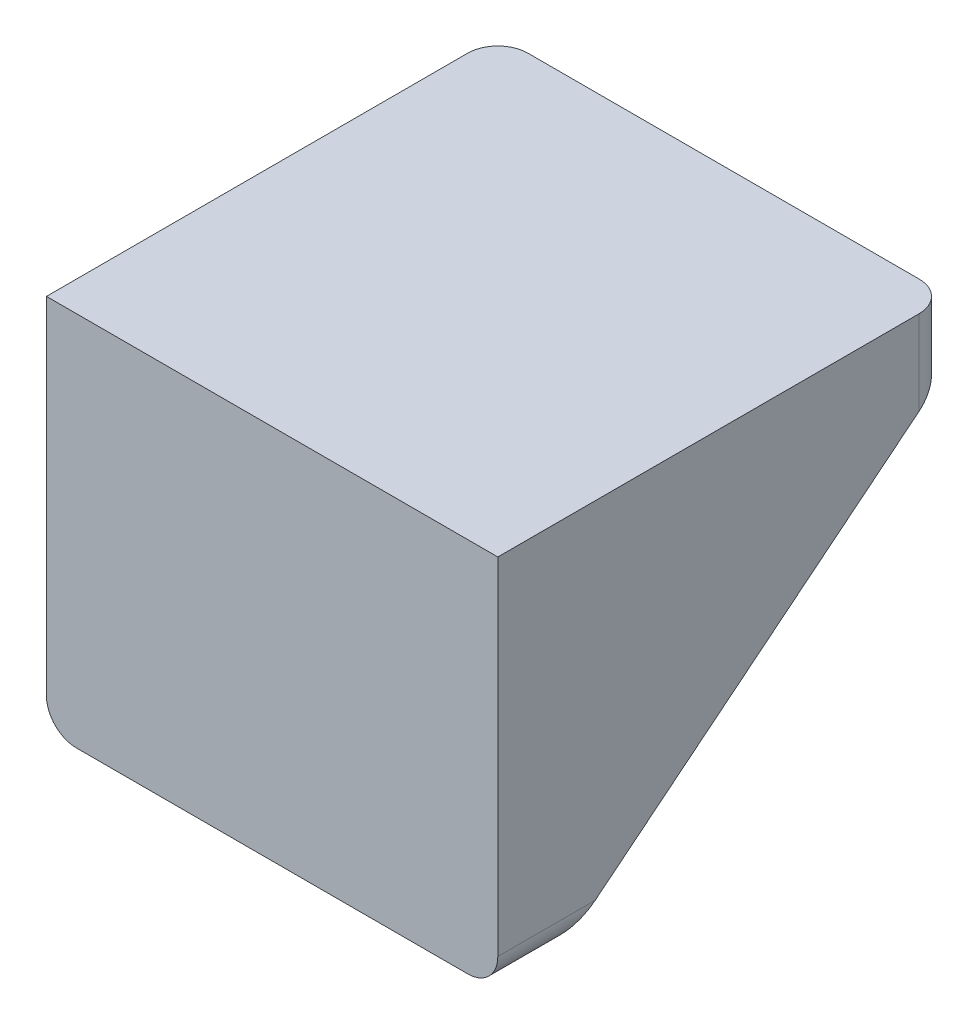
ISO-10303-21;
HEADER;
FILE_DESCRIPTION(('STEP AP214'),'2;1');
FILE_NAME('part.step','',(''),(''),'','','');
FILE_SCHEMA(('AUTOMOTIVE_DESIGN { 1 0 10303 214 1 1 1 1 }'));
ENDSEC;
DATA;
#1=APPLICATION_CONTEXT('core data for automotive mechanical design processes');
#2=APPLICATION_PROTOCOL_DEFINITION('international standard','automotive_design',2000,#1);
#3=PRODUCT_CONTEXT('',#1,'mechanical');
#4=PRODUCT('Part','Part','',(#3));
#5=PRODUCT_RELATED_PRODUCT_CATEGORY('part','',(#4));
#6=PRODUCT_DEFINITION_FORMATION('','',#4);
#7=PRODUCT_DEFINITION_CONTEXT('part definition',#1,'design');
#8=PRODUCT_DEFINITION('design','',#6,#7);
#9=PRODUCT_DEFINITION_SHAPE('','',#8);
#10=(LENGTH_UNIT() NAMED_UNIT(*) SI_UNIT(.MILLI.,.METRE.));
#11=(NAMED_UNIT(*) PLANE_ANGLE_UNIT() SI_UNIT($,.RADIAN.));
#12=(NAMED_UNIT(*) SI_UNIT($,.STERADIAN.) SOLID_ANGLE_UNIT());
#13=UNCERTAINTY_MEASURE_WITH_UNIT(LENGTH_MEASURE(1.E-05),#10,'distance_accuracy_value','');
#14=(GEOMETRIC_REPRESENTATION_CONTEXT(3) GLOBAL_UNCERTAINTY_ASSIGNED_CONTEXT((#13)) GLOBAL_UNIT_ASSIGNED_CONTEXT((#10,
#11,#12)) REPRESENTATION_CONTEXT('',''));
#15=CARTESIAN_POINT('',(0.,0.,0.));
#16=DIRECTION('',(0.,0.,1.));
#17=DIRECTION('',(1.,0.,0.));
#18=AXIS2_PLACEMENT_3D('',#15,#16,#17);
#19=CARTESIAN_POINT('',(15.,-12.5,-4.));
#20=DIRECTION('',(0.,0.,1.));
#21=DIRECTION('',(1.,0.,0.));
#22=AXIS2_PLACEMENT_3D('',#19,#20,#21);
#23=PLANE('',#22);
#24=DIRECTION('',(0.,-1.,0.));
#25=VECTOR('',#24,1.);
#26=CARTESIAN_POINT('',(-11.,-12.5,-4.));
#27=LINE('',#26,#25);
#28=CARTESIAN_POINT('',(-11.,8.5,-4.));
#29=VERTEX_POINT('',#28);
#30=CARTESIAN_POINT('',(-11.,-12.5,-4.));
#31=VERTEX_POINT('',#30);
#32=EDGE_CURVE('E145',#29,#31,#27,.T.);
#33=ORIENTED_EDGE('',*,*,#32,.F.);
#34=DIRECTION('',(-1.,0.,0.));
#35=VECTOR('',#34,1.);
#36=CARTESIAN_POINT('',(15.,8.5,-4.));
#37=LINE('',#36,#35);
#38=CARTESIAN_POINT('',(11.,8.5,-4.));
#39=VERTEX_POINT('',#38);
#40=EDGE_CURVE('E138',#39,#29,#37,.T.);
#41=ORIENTED_EDGE('',*,*,#40,.F.);
#42=DIRECTION('',(0.,-1.,0.));
#43=VECTOR('',#42,1.);
#44=CARTESIAN_POINT('',(11.,-12.5,-4.));
#45=LINE('',#44,#43);
#46=CARTESIAN_POINT('',(11.,-12.5,-4.));
#47=VERTEX_POINT('',#46);
#48=EDGE_CURVE('E123',#39,#47,#45,.T.);
#49=ORIENTED_EDGE('',*,*,#48,.T.);
#50=DIRECTION('',(-1.,0.,0.));
#51=VECTOR('',#50,1.);
#52=CARTESIAN_POINT('',(15.,-12.5,-4.));
#53=LINE('',#52,#51);
#54=EDGE_CURVE('E146',#47,#31,#53,.T.);
#55=ORIENTED_EDGE('',*,*,#54,.T.);
#56=EDGE_LOOP('',(#33,#41,#49,#55));
#57=FACE_BOUND('',#56,.T.);
#58=ADVANCED_FACE('F33',(#57),#23,.F.);
#59=CARTESIAN_POINT('',(15.,8.5,-4.));
#60=DIRECTION('',(0.,1.,0.));
#61=DIRECTION('',(0.,0.,1.));
#62=AXIS2_PLACEMENT_3D('',#59,#60,#61);
#63=PLANE('',#62);
#64=DIRECTION('',(0.,0.,1.));
#65=VECTOR('',#64,1.);
#66=CARTESIAN_POINT('',(-11.,8.5,-4.));
#67=LINE('',#66,#65);
#68=CARTESIAN_POINT('',(-11.,8.5,-30.));
#69=VERTEX_POINT('',#68);
#70=EDGE_CURVE('E233',#69,#29,#67,.T.);
#71=ORIENTED_EDGE('',*,*,#70,.F.);
#72=DIRECTION('',(-1.,0.,0.));
#73=VECTOR('',#72,1.);
#74=CARTESIAN_POINT('',(15.,8.5,-30.));
#75=LINE('',#74,#73);
#76=CARTESIAN_POINT('',(11.,8.5,-30.));
#77=VERTEX_POINT('',#76);
#78=EDGE_CURVE('E141',#77,#69,#75,.T.);
#79=ORIENTED_EDGE('',*,*,#78,.F.);
#80=DIRECTION('',(0.,0.,1.));
#81=VECTOR('',#80,1.);
#82=CARTESIAN_POINT('',(11.,8.5,-4.));
#83=LINE('',#82,#81);
#84=EDGE_CURVE('E126',#77,#39,#83,.T.);
#85=ORIENTED_EDGE('',*,*,#84,.T.);
#86=ORIENTED_EDGE('',*,*,#40,.T.);
#87=EDGE_LOOP('',(#71,#79,#85,#86));
#88=FACE_BOUND('',#87,.T.);
#89=ADVANCED_FACE('F137',(#88),#63,.F.);
#90=CARTESIAN_POINT('',(15.,12.5,-30.));
#91=DIRECTION('',(0.,0.,1.));
#92=DIRECTION('',(1.,0.,0.));
#93=AXIS2_PLACEMENT_3D('',#90,#91,#92);
#94=PLANE('',#93);
#95=DIRECTION('',(-1.,0.,0.));
#96=VECTOR('',#95,1.);
#97=CARTESIAN_POINT('',(-11.,8.5,-30.));
#98=LINE('',#97,#96);
#99=CARTESIAN_POINT('',(-13.,8.5,-30.));
#100=VERTEX_POINT('',#99);
#101=EDGE_CURVE('E205',#69,#100,#98,.T.);
#102=ORIENTED_EDGE('',*,*,#101,.T.);
#103=DIRECTION('',(0.,1.,0.));
#104=VECTOR('',#103,1.);
#105=CARTESIAN_POINT('',(-13.,12.5,-30.));
#106=LINE('',#105,#104);
#107=CARTESIAN_POINT('',(-13.,12.5,-30.));
#108=VERTEX_POINT('',#107);
#109=EDGE_CURVE('E164',#100,#108,#106,.T.);
#110=ORIENTED_EDGE('',*,*,#109,.T.);
#111=DIRECTION('',(-1.,0.,0.));
#112=VECTOR('',#111,1.);
#113=CARTESIAN_POINT('',(15.,12.5,-30.));
#114=LINE('',#113,#112);
#115=CARTESIAN_POINT('',(13.,12.5,-30.));
#116=VERTEX_POINT('',#115);
#117=EDGE_CURVE('E159',#116,#108,#114,.T.);
#118=ORIENTED_EDGE('',*,*,#117,.F.);
#119=DIRECTION('',(0.,1.,0.));
#120=VECTOR('',#119,1.);
#121=CARTESIAN_POINT('',(13.,8.5,-30.));
#122=LINE('',#121,#120);
#123=CARTESIAN_POINT('',(13.,8.5,-30.));
#124=VERTEX_POINT('',#123);
#125=EDGE_CURVE('E162',#116,#124,#122,.F.);
#126=ORIENTED_EDGE('',*,*,#125,.T.);
#127=EDGE_CURVE('E147',#124,#77,#75,.T.);
#128=ORIENTED_EDGE('',*,*,#127,.T.);
#129=ORIENTED_EDGE('',*,*,#78,.T.);
#130=EDGE_LOOP('',(#102,#110,#118,#126,#128,#129));
#131=FACE_BOUND('',#130,.T.);
#132=ADVANCED_FACE('F240',(#131),#94,.F.);
#133=CARTESIAN_POINT('',(15.,12.5,0.));
#134=DIRECTION('',(0.,-1.,0.));
#135=DIRECTION('',(0.,0.,-1.));
#136=AXIS2_PLACEMENT_3D('',#133,#134,#135);
#137=PLANE('',#136);
#138=ORIENTED_EDGE('',*,*,#117,.T.);
#139=CARTESIAN_POINT('',(-13.,12.5,-28.));
#140=DIRECTION('',(0.,-1.,0.));
#141=DIRECTION('',(0.,0.,-1.));
#142=AXIS2_PLACEMENT_3D('',#139,#140,#141);
#143=CIRCLE('',#142,2.);
#144=CARTESIAN_POINT('',(-15.,12.5,-28.));
#145=VERTEX_POINT('',#144);
#146=EDGE_CURVE('E169',#108,#145,#143,.F.);
#147=ORIENTED_EDGE('',*,*,#146,.T.);
#148=DIRECTION('',(0.,0.,1.));
#149=VECTOR('',#148,1.);
#150=CARTESIAN_POINT('',(-15.,12.5,0.));
#151=LINE('',#150,#149);
#152=CARTESIAN_POINT('',(-15.,12.5,0.));
#153=VERTEX_POINT('',#152);
#154=EDGE_CURVE('E215',#145,#153,#151,.T.);
#155=ORIENTED_EDGE('',*,*,#154,.T.);
#156=DIRECTION('',(-1.,0.,0.));
#157=VECTOR('',#156,1.);
#158=CARTESIAN_POINT('',(15.,12.5,0.));
#159=LINE('',#158,#157);
#160=CARTESIAN_POINT('',(15.,12.5,0.));
#161=VERTEX_POINT('',#160);
#162=EDGE_CURVE('E156',#161,#153,#159,.T.);
#163=ORIENTED_EDGE('',*,*,#162,.F.);
#164=DIRECTION('',(0.,0.,1.));
#165=VECTOR('',#164,1.);
#166=CARTESIAN_POINT('',(15.,12.5,0.));
#167=LINE('',#166,#165);
#168=CARTESIAN_POINT('',(15.,12.5,-28.));
#169=VERTEX_POINT('',#168);
#170=EDGE_CURVE('E217',#169,#161,#167,.T.);
#171=ORIENTED_EDGE('',*,*,#170,.F.);
#172=CARTESIAN_POINT('',(13.,12.5,-28.));
#173=DIRECTION('',(0.,-1.,0.));
#174=DIRECTION('',(0.,0.,-1.));
#175=AXIS2_PLACEMENT_3D('',#172,#173,#174);
#176=CIRCLE('',#175,2.);
#177=EDGE_CURVE('E167',#169,#116,#176,.F.);
#178=ORIENTED_EDGE('',*,*,#177,.T.);
#179=EDGE_LOOP('',(#138,#147,#155,#163,#171,#178));
#180=FACE_BOUND('',#179,.T.);
#181=ADVANCED_FACE('F245',(#180),#137,.F.);
#182=CARTESIAN_POINT('',(15.,-12.5,0.));
#183=DIRECTION('',(0.,0.,-1.));
#184=DIRECTION('',(0.,1.,0.));
#185=AXIS2_PLACEMENT_3D('',#182,#183,#184);
#186=PLANE('',#185);
#187=DIRECTION('',(-1.,0.,0.));
#188=VECTOR('',#187,1.);
#189=CARTESIAN_POINT('',(15.,-12.5,0.));
#190=LINE('',#189,#188);
#191=CARTESIAN_POINT('',(13.,-12.5,0.));
#192=VERTEX_POINT('',#191);
#193=CARTESIAN_POINT('',(-13.,-12.5,0.));
#194=VERTEX_POINT('',#193);
#195=EDGE_CURVE('E154',#192,#194,#190,.T.);
#196=ORIENTED_EDGE('',*,*,#195,.F.);
#197=CARTESIAN_POINT('',(13.,-10.5,0.));
#198=DIRECTION('',(0.,0.,-1.));
#199=DIRECTION('',(0.,1.,0.));
#200=AXIS2_PLACEMENT_3D('',#197,#198,#199);
#201=CIRCLE('',#200,2.);
#202=CARTESIAN_POINT('',(15.,-10.5,0.));
#203=VERTEX_POINT('',#202);
#204=EDGE_CURVE('E11',#192,#203,#201,.F.);
#205=ORIENTED_EDGE('',*,*,#204,.T.);
#206=DIRECTION('',(0.,-1.,0.));
#207=VECTOR('',#206,1.);
#208=CARTESIAN_POINT('',(15.,-12.5,0.));
#209=LINE('',#208,#207);
#210=EDGE_CURVE('E219',#161,#203,#209,.T.);
#211=ORIENTED_EDGE('',*,*,#210,.F.);
#212=ORIENTED_EDGE('',*,*,#162,.T.);
#213=DIRECTION('',(0.,-1.,0.));
#214=VECTOR('',#213,1.);
#215=CARTESIAN_POINT('',(-15.,-12.5,0.));
#216=LINE('',#215,#214);
#217=CARTESIAN_POINT('',(-15.,-10.5,0.));
#218=VERTEX_POINT('',#217);
#219=EDGE_CURVE('E220',#153,#218,#216,.T.);
#220=ORIENTED_EDGE('',*,*,#219,.T.);
#221=CARTESIAN_POINT('',(-13.,-10.5,0.));
#222=DIRECTION('',(0.,0.,-1.));
#223=DIRECTION('',(0.,1.,0.));
#224=AXIS2_PLACEMENT_3D('',#221,#222,#223);
#225=CIRCLE('',#224,2.);
#226=EDGE_CURVE('E41',#218,#194,#225,.F.);
#227=ORIENTED_EDGE('',*,*,#226,.T.);
#228=EDGE_LOOP('',(#196,#205,#211,#212,#220,#227));
#229=FACE_BOUND('',#228,.T.);
#230=ADVANCED_FACE('F224',(#229),#186,.F.);
#231=CARTESIAN_POINT('',(15.,-12.5,0.));
#232=DIRECTION('',(0.,1.,0.));
#233=DIRECTION('',(0.,0.,1.));
#234=AXIS2_PLACEMENT_3D('',#231,#232,#233);
#235=PLANE('',#234);
#236=CARTESIAN_POINT('',(13.,-12.5,-4.));
#237=VERTEX_POINT('',#236);
#238=EDGE_CURVE('E149',#237,#47,#53,.T.);
#239=ORIENTED_EDGE('',*,*,#238,.F.);
#240=DIRECTION('',(0.,0.,-1.));
#241=VECTOR('',#240,1.);
#242=CARTESIAN_POINT('',(13.,-12.5,0.));
#243=LINE('',#242,#241);
#244=EDGE_CURVE('E54',#237,#192,#243,.F.);
#245=ORIENTED_EDGE('',*,*,#244,.T.);
#246=ORIENTED_EDGE('',*,*,#195,.T.);
#247=DIRECTION('',(0.,0.,-1.));
#248=VECTOR('',#247,1.);
#249=CARTESIAN_POINT('',(-13.,-12.5,0.));
#250=LINE('',#249,#248);
#251=CARTESIAN_POINT('',(-13.,-12.5,-4.));
#252=VERTEX_POINT('',#251);
#253=EDGE_CURVE('E189',#194,#252,#250,.T.);
#254=ORIENTED_EDGE('',*,*,#253,.T.);
#255=DIRECTION('',(-1.,0.,0.));
#256=VECTOR('',#255,1.);
#257=CARTESIAN_POINT('',(-11.,-12.5,-4.));
#258=LINE('',#257,#256);
#259=EDGE_CURVE('E195',#31,#252,#258,.T.);
#260=ORIENTED_EDGE('',*,*,#259,.F.);
#261=ORIENTED_EDGE('',*,*,#54,.F.);
#262=EDGE_LOOP('',(#239,#245,#246,#254,#260,#261));
#263=FACE_BOUND('',#262,.T.);
#264=ADVANCED_FACE('F194',(#263),#235,.F.);
#265=CARTESIAN_POINT('',(15.,0.,0.));
#266=DIRECTION('',(1.,0.,0.));
#267=DIRECTION('',(0.,0.,-1.));
#268=AXIS2_PLACEMENT_3D('',#265,#266,#267);
#269=PLANE('',#268);
#270=DIRECTION('',(0.,0.628337107087621,-0.777941180203721));
#271=VECTOR('',#270,1.);
#272=CARTESIAN_POINT('',(15.,8.5,-30.));
#273=LINE('',#272,#271);
#274=CARTESIAN_POINT('',(15.,-10.5,-6.47619047619048));
#275=VERTEX_POINT('',#274);
#276=CARTESIAN_POINT('',(15.,6.88461538461539,-28.));
#277=VERTEX_POINT('',#276);
#278=EDGE_CURVE('E142',#275,#277,#273,.T.);
#279=ORIENTED_EDGE('',*,*,#278,.T.);
#280=DIRECTION('',(0.,1.,0.));
#281=VECTOR('',#280,1.);
#282=CARTESIAN_POINT('',(15.,12.5,-28.));
#283=LINE('',#282,#281);
#284=EDGE_CURVE('E182',#277,#169,#283,.T.);
#285=ORIENTED_EDGE('',*,*,#284,.T.);
#286=ORIENTED_EDGE('',*,*,#170,.T.);
#287=ORIENTED_EDGE('',*,*,#210,.T.);
#288=DIRECTION('',(0.,0.,-1.));
#289=VECTOR('',#288,1.);
#290=CARTESIAN_POINT('',(15.,-10.5,-4.));
#291=LINE('',#290,#289);
#292=EDGE_CURVE('E179',#203,#275,#291,.T.);
#293=ORIENTED_EDGE('',*,*,#292,.T.);
#294=EDGE_LOOP('',(#279,#285,#286,#287,#293));
#295=FACE_BOUND('',#294,.T.);
#296=ADVANCED_FACE('F257',(#295),#269,.T.);
#297=CARTESIAN_POINT('',(-15.,0.,0.));
#298=DIRECTION('',(1.,0.,0.));
#299=DIRECTION('',(0.,0.,-1.));
#300=AXIS2_PLACEMENT_3D('',#297,#298,#299);
#301=PLANE('',#300);
#302=ORIENTED_EDGE('',*,*,#154,.F.);
#303=DIRECTION('',(0.,1.,0.));
#304=VECTOR('',#303,1.);
#305=CARTESIAN_POINT('',(-15.,0.,-28.));
#306=LINE('',#305,#304);
#307=CARTESIAN_POINT('',(-15.,6.88461538461539,-28.));
#308=VERTEX_POINT('',#307);
#309=EDGE_CURVE('E173',#145,#308,#306,.F.);
#310=ORIENTED_EDGE('',*,*,#309,.T.);
#311=DIRECTION('',(0.,0.628337107087621,-0.777941180203721));
#312=VECTOR('',#311,1.);
#313=CARTESIAN_POINT('',(-15.,8.5,-30.));
#314=LINE('',#313,#312);
#315=CARTESIAN_POINT('',(-15.,-10.5,-6.47619047619048));
#316=VERTEX_POINT('',#315);
#317=EDGE_CURVE('E212',#316,#308,#314,.T.);
#318=ORIENTED_EDGE('',*,*,#317,.F.);
#319=DIRECTION('',(0.,0.,-1.));
#320=VECTOR('',#319,1.);
#321=CARTESIAN_POINT('',(-15.,-10.5,0.));
#322=LINE('',#321,#320);
#323=EDGE_CURVE('E171',#316,#218,#322,.F.);
#324=ORIENTED_EDGE('',*,*,#323,.T.);
#325=ORIENTED_EDGE('',*,*,#219,.F.);
#326=EDGE_LOOP('',(#302,#310,#318,#324,#325));
#327=FACE_BOUND('',#326,.T.);
#328=ADVANCED_FACE('F230',(#327),#301,.F.);
#329=CARTESIAN_POINT('',(11.,8.5,-30.));
#330=DIRECTION('',(0.,-0.777941180203721,-0.628337107087621));
#331=DIRECTION('',(0.,0.628337107087621,-0.777941180203722));
#332=AXIS2_PLACEMENT_3D('',#329,#330,#331);
#333=PLANE('',#332);
#334=ORIENTED_EDGE('',*,*,#127,.F.);
#335=CARTESIAN_POINT('',(13.,6.88461538461539,-28.));
#336=DIRECTION('',(0.,-0.777941180203721,-0.628337107087621));
#337=DIRECTION('',(0.,-0.628337107087621,0.777941180203722));
#338=AXIS2_PLACEMENT_3D('',#335,#336,#337);
#339=ELLIPSE('',#338,2.57088845647206,2.);
#340=EDGE_CURVE('E187',#124,#277,#339,.T.);
#341=ORIENTED_EDGE('',*,*,#340,.T.);
#342=ORIENTED_EDGE('',*,*,#278,.F.);
#343=CARTESIAN_POINT('',(13.,-10.5,-6.47619047619048));
#344=DIRECTION('',(0.,-0.777941180203721,-0.628337107087621));
#345=DIRECTION('',(0.,-0.628337107087621,0.777941180203721));
#346=AXIS2_PLACEMENT_3D('',#343,#344,#345);
#347=ELLIPSE('',#346,3.18300475563208,2.);
#348=EDGE_CURVE('E185',#275,#237,#347,.T.);
#349=ORIENTED_EDGE('',*,*,#348,.T.);
#350=ORIENTED_EDGE('',*,*,#238,.T.);
#351=DIRECTION('',(0.,0.628337107087621,-0.777941180203721));
#352=VECTOR('',#351,1.);
#353=CARTESIAN_POINT('',(11.,8.5,-30.));
#354=LINE('',#353,#352);
#355=EDGE_CURVE('E128',#47,#77,#354,.T.);
#356=ORIENTED_EDGE('',*,*,#355,.T.);
#357=EDGE_LOOP('',(#334,#341,#342,#349,#350,#356));
#358=FACE_BOUND('',#357,.T.);
#359=ADVANCED_FACE('F255',(#358),#333,.T.);
#360=CARTESIAN_POINT('',(11.,0.,0.));
#361=DIRECTION('',(1.,0.,0.));
#362=DIRECTION('',(0.,0.,-1.));
#363=AXIS2_PLACEMENT_3D('',#360,#361,#362);
#364=PLANE('',#363);
#365=ORIENTED_EDGE('',*,*,#84,.F.);
#366=ORIENTED_EDGE('',*,*,#355,.F.);
#367=ORIENTED_EDGE('',*,*,#48,.F.);
#368=EDGE_LOOP('',(#365,#366,#367));
#369=FACE_BOUND('',#368,.T.);
#370=ADVANCED_FACE('F125',(#369),#364,.F.);
#371=CARTESIAN_POINT('',(-11.,8.5,-30.));
#372=DIRECTION('',(0.,0.777941180203721,0.628337107087621));
#373=DIRECTION('',(0.,-0.628337107087621,0.777941180203722));
#374=AXIS2_PLACEMENT_3D('',#371,#372,#373);
#375=PLANE('',#374);
#376=ORIENTED_EDGE('',*,*,#317,.T.);
#377=CARTESIAN_POINT('',(-13.,6.88461538461539,-28.));
#378=DIRECTION('',(0.,0.777941180203721,0.628337107087621));
#379=DIRECTION('',(0.,0.628337107087621,-0.777941180203722));
#380=AXIS2_PLACEMENT_3D('',#377,#378,#379);
#381=ELLIPSE('',#380,2.57088845647206,2.);
#382=EDGE_CURVE('E177',#308,#100,#381,.F.);
#383=ORIENTED_EDGE('',*,*,#382,.T.);
#384=ORIENTED_EDGE('',*,*,#101,.F.);
#385=DIRECTION('',(0.,0.628337107087621,-0.777941180203721));
#386=VECTOR('',#385,1.);
#387=CARTESIAN_POINT('',(-11.,8.5,-30.));
#388=LINE('',#387,#386);
#389=EDGE_CURVE('E204',#31,#69,#388,.T.);
#390=ORIENTED_EDGE('',*,*,#389,.F.);
#391=ORIENTED_EDGE('',*,*,#259,.T.);
#392=CARTESIAN_POINT('',(-13.,-10.5,-6.47619047619048));
#393=DIRECTION('',(0.,0.777941180203721,0.628337107087621));
#394=DIRECTION('',(0.,0.628337107087621,-0.777941180203721));
#395=AXIS2_PLACEMENT_3D('',#392,#393,#394);
#396=ELLIPSE('',#395,3.18300475563208,2.);
#397=EDGE_CURVE('E175',#252,#316,#396,.F.);
#398=ORIENTED_EDGE('',*,*,#397,.T.);
#399=EDGE_LOOP('',(#376,#383,#384,#390,#391,#398));
#400=FACE_BOUND('',#399,.T.);
#401=ADVANCED_FACE('F200',(#400),#375,.F.);
#402=CARTESIAN_POINT('',(-11.,0.,0.));
#403=DIRECTION('',(-1.,0.,0.));
#404=DIRECTION('',(0.,0.,-1.));
#405=AXIS2_PLACEMENT_3D('',#402,#403,#404);
#406=PLANE('',#405);
#407=ORIENTED_EDGE('',*,*,#70,.T.);
#408=ORIENTED_EDGE('',*,*,#32,.T.);
#409=ORIENTED_EDGE('',*,*,#389,.T.);
#410=EDGE_LOOP('',(#407,#408,#409));
#411=FACE_BOUND('',#410,.T.);
#412=ADVANCED_FACE('F237',(#411),#406,.F.);
#413=CARTESIAN_POINT('',(-13.,12.5,-28.));
#414=DIRECTION('',(0.,1.,0.));
#415=DIRECTION('',(0.,0.,1.));
#416=AXIS2_PLACEMENT_3D('',#413,#414,#415);
#417=CYLINDRICAL_SURFACE('',#416,2.);
#418=ORIENTED_EDGE('',*,*,#382,.F.);
#419=ORIENTED_EDGE('',*,*,#309,.F.);
#420=ORIENTED_EDGE('',*,*,#146,.F.);
#421=ORIENTED_EDGE('',*,*,#109,.F.);
#422=EDGE_LOOP('',(#418,#419,#420,#421));
#423=FACE_BOUND('',#422,.T.);
#424=ADVANCED_FACE('F243',(#423),#417,.T.);
#425=CARTESIAN_POINT('',(13.,0.,-28.));
#426=DIRECTION('',(0.,-1.,0.));
#427=DIRECTION('',(0.,0.,-1.));
#428=AXIS2_PLACEMENT_3D('',#425,#426,#427);
#429=CYLINDRICAL_SURFACE('',#428,2.);
#430=ORIENTED_EDGE('',*,*,#340,.F.);
#431=ORIENTED_EDGE('',*,*,#125,.F.);
#432=ORIENTED_EDGE('',*,*,#177,.F.);
#433=ORIENTED_EDGE('',*,*,#284,.F.);
#434=EDGE_LOOP('',(#430,#431,#432,#433));
#435=FACE_BOUND('',#434,.T.);
#436=ADVANCED_FACE('F251',(#435),#429,.T.);
#437=CARTESIAN_POINT('',(13.,-10.5,0.));
#438=DIRECTION('',(0.,0.,1.));
#439=DIRECTION('',(1.,0.,0.));
#440=AXIS2_PLACEMENT_3D('',#437,#438,#439);
#441=CYLINDRICAL_SURFACE('',#440,2.);
#442=ORIENTED_EDGE('',*,*,#204,.F.);
#443=ORIENTED_EDGE('',*,*,#244,.F.);
#444=ORIENTED_EDGE('',*,*,#348,.F.);
#445=ORIENTED_EDGE('',*,*,#292,.F.);
#446=EDGE_LOOP('',(#442,#443,#444,#445));
#447=FACE_BOUND('',#446,.T.);
#448=ADVANCED_FACE('F261',(#447),#441,.T.);
#449=CARTESIAN_POINT('',(-13.,-10.5,0.));
#450=DIRECTION('',(0.,0.,-1.));
#451=DIRECTION('',(-1.,0.,0.));
#452=AXIS2_PLACEMENT_3D('',#449,#450,#451);
#453=CYLINDRICAL_SURFACE('',#452,2.);
#454=ORIENTED_EDGE('',*,*,#226,.F.);
#455=ORIENTED_EDGE('',*,*,#323,.F.);
#456=ORIENTED_EDGE('',*,*,#397,.F.);
#457=ORIENTED_EDGE('',*,*,#253,.F.);
#458=EDGE_LOOP('',(#454,#455,#456,#457));
#459=FACE_BOUND('',#458,.T.);
#460=ADVANCED_FACE('F35',(#459),#453,.T.);
#461=CLOSED_SHELL('',(#58,#89,#132,#181,#230,#264,#296,#328,#359,#370,#401,#412,#424,#436,#448,#460));
#462=MANIFOLD_SOLID_BREP('B2',#461);
#463=ADVANCED_BREP_SHAPE_REPRESENTATION('',(#18,#462),#14);
#464=SHAPE_DEFINITION_REPRESENTATION(#9,#463);
ENDSEC;
END-ISO-10303-21;
